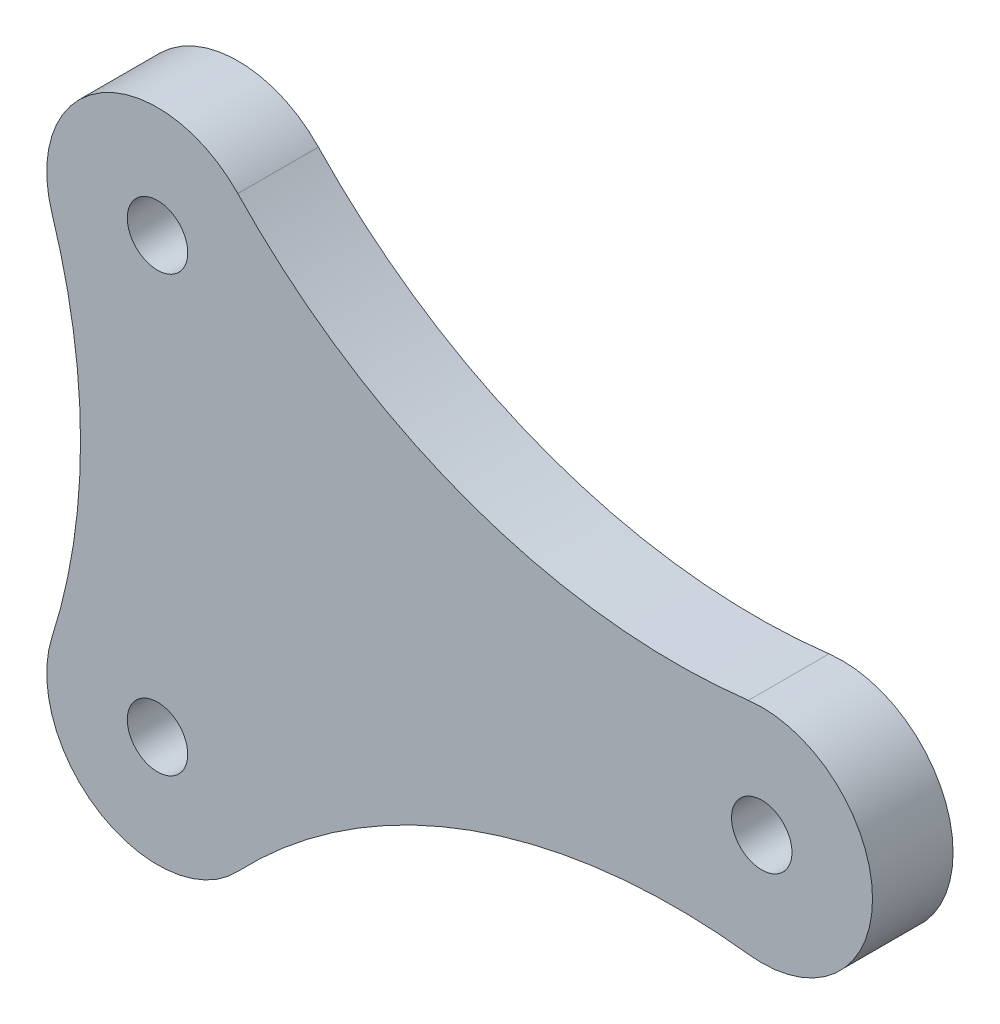
ISO-10303-21;
HEADER;
FILE_DESCRIPTION(('STEP AP214'),'2;1');
FILE_NAME('part.step','',(''),(''),'','','');
FILE_SCHEMA(('AUTOMOTIVE_DESIGN { 1 0 10303 214 1 1 1 1 }'));
ENDSEC;
DATA;
#1=APPLICATION_CONTEXT('core data for automotive mechanical design processes');
#2=APPLICATION_PROTOCOL_DEFINITION('international standard','automotive_design',2000,#1);
#3=PRODUCT_CONTEXT('',#1,'mechanical');
#4=PRODUCT('Part','Part','',(#3));
#5=PRODUCT_RELATED_PRODUCT_CATEGORY('part','',(#4));
#6=PRODUCT_DEFINITION_FORMATION('','',#4);
#7=PRODUCT_DEFINITION_CONTEXT('part definition',#1,'design');
#8=PRODUCT_DEFINITION('design','',#6,#7);
#9=PRODUCT_DEFINITION_SHAPE('','',#8);
#10=(LENGTH_UNIT() NAMED_UNIT(*) SI_UNIT(.MILLI.,.METRE.));
#11=(NAMED_UNIT(*) PLANE_ANGLE_UNIT() SI_UNIT($,.RADIAN.));
#12=(NAMED_UNIT(*) SI_UNIT($,.STERADIAN.) SOLID_ANGLE_UNIT());
#13=UNCERTAINTY_MEASURE_WITH_UNIT(LENGTH_MEASURE(1.E-05),#10,'distance_accuracy_value','');
#14=(GEOMETRIC_REPRESENTATION_CONTEXT(3) GLOBAL_UNCERTAINTY_ASSIGNED_CONTEXT((#13)) GLOBAL_UNIT_ASSIGNED_CONTEXT((#10,
#11,#12)) REPRESENTATION_CONTEXT('',''));
#15=CARTESIAN_POINT('',(0.,0.,0.));
#16=DIRECTION('',(0.,0.,1.));
#17=DIRECTION('',(1.,0.,0.));
#18=AXIS2_PLACEMENT_3D('',#15,#16,#17);
#19=CARTESIAN_POINT('',(-33.8220900448213,10.785,4.));
#20=DIRECTION('',(0.,0.,-1.));
#21=DIRECTION('',(-1.,0.,0.));
#22=AXIS2_PLACEMENT_3D('',#19,#20,#21);
#23=CYLINDRICAL_SURFACE('',#22,30.);
#24=CARTESIAN_POINT('',(-33.8220900448213,10.785,0.));
#25=DIRECTION('',(0.,0.,1.));
#26=DIRECTION('',(1.,0.,0.));
#27=AXIS2_PLACEMENT_3D('',#24,#25,#26);
#28=CIRCLE('',#27,30.);
#29=CARTESIAN_POINT('',(-5.2400421196202,19.8990845070423,0.));
#30=VERTEX_POINT('',#29);
#31=CARTESIAN_POINT('',(-5.2400421196202,1.67091549295775,0.));
#32=VERTEX_POINT('',#31);
#33=EDGE_CURVE('E130',#30,#32,#28,.F.);
#34=ORIENTED_EDGE('',*,*,#33,.T.);
#35=DIRECTION('',(0.,0.,-1.));
#36=VECTOR('',#35,1.);
#37=CARTESIAN_POINT('',(-5.2400421196202,1.67091549295775,4.));
#38=LINE('',#37,#36);
#39=CARTESIAN_POINT('',(-5.2400421196202,1.67091549295775,4.));
#40=VERTEX_POINT('',#39);
#41=EDGE_CURVE('E11',#40,#32,#38,.T.);
#42=ORIENTED_EDGE('',*,*,#41,.F.);
#43=CARTESIAN_POINT('',(-33.8220900448213,10.785,4.));
#44=DIRECTION('',(0.,0.,1.));
#45=DIRECTION('',(1.,0.,0.));
#46=AXIS2_PLACEMENT_3D('',#43,#44,#45);
#47=CIRCLE('',#46,30.);
#48=CARTESIAN_POINT('',(-5.2400421196202,19.8990845070423,4.));
#49=VERTEX_POINT('',#48);
#50=EDGE_CURVE('E150',#49,#40,#47,.F.);
#51=ORIENTED_EDGE('',*,*,#50,.F.);
#52=DIRECTION('',(0.,0.,-1.));
#53=VECTOR('',#52,1.);
#54=CARTESIAN_POINT('',(-5.2400421196202,19.8990845070423,4.));
#55=LINE('',#54,#53);
#56=EDGE_CURVE('E129',#49,#30,#55,.T.);
#57=ORIENTED_EDGE('',*,*,#56,.T.);
#58=EDGE_LOOP('',(#34,#42,#51,#57));
#59=FACE_BOUND('',#58,.T.);
#60=ADVANCED_FACE('F37',(#59),#23,.F.);
#61=CARTESIAN_POINT('',(0.,0.,4.));
#62=DIRECTION('',(0.,0.,-1.));
#63=DIRECTION('',(-1.,0.,0.));
#64=AXIS2_PLACEMENT_3D('',#61,#62,#63);
#65=CYLINDRICAL_SURFACE('',#64,5.5);
#66=CARTESIAN_POINT('',(0.,0.,0.));
#67=DIRECTION('',(0.,0.,1.));
#68=DIRECTION('',(1.,0.,0.));
#69=AXIS2_PLACEMENT_3D('',#66,#67,#68);
#70=CIRCLE('',#69,5.5);
#71=CARTESIAN_POINT('',(3.98649835890473,-3.78917284304239,0.));
#72=VERTEX_POINT('',#71);
#73=EDGE_CURVE('E133',#32,#72,#70,.T.);
#74=ORIENTED_EDGE('',*,*,#73,.T.);
#75=DIRECTION('',(0.,0.,-1.));
#76=VECTOR('',#75,1.);
#77=CARTESIAN_POINT('',(3.98649835890473,-3.78917284304239,4.));
#78=LINE('',#77,#76);
#79=CARTESIAN_POINT('',(3.98649835890473,-3.78917284304239,4.));
#80=VERTEX_POINT('',#79);
#81=EDGE_CURVE('E45',#80,#72,#78,.T.);
#82=ORIENTED_EDGE('',*,*,#81,.F.);
#83=CARTESIAN_POINT('',(0.,0.,4.));
#84=DIRECTION('',(0.,0.,1.));
#85=DIRECTION('',(1.,0.,0.));
#86=AXIS2_PLACEMENT_3D('',#83,#84,#85);
#87=CIRCLE('',#86,5.5);
#88=EDGE_CURVE('E86',#40,#80,#87,.T.);
#89=ORIENTED_EDGE('',*,*,#88,.F.);
#90=ORIENTED_EDGE('',*,*,#41,.T.);
#91=EDGE_LOOP('',(#74,#82,#89,#90));
#92=FACE_BOUND('',#91,.T.);
#93=ADVANCED_FACE('F180',(#92),#65,.T.);
#94=CARTESIAN_POINT('',(25.7310348620214,-24.4573883505463,4.));
#95=DIRECTION('',(0.,0.,-1.));
#96=DIRECTION('',(-1.,0.,0.));
#97=AXIS2_PLACEMENT_3D('',#94,#95,#96);
#98=CYLINDRICAL_SURFACE('',#97,30.);
#99=CARTESIAN_POINT('',(25.7310348620214,-24.4573883505463,0.));
#100=DIRECTION('',(0.,0.,1.));
#101=DIRECTION('',(1.,0.,0.));
#102=AXIS2_PLACEMENT_3D('',#99,#100,#101);
#103=CIRCLE('',#102,30.);
#104=CARTESIAN_POINT('',(29.3386110349611,5.32491166399987,0.));
#105=VERTEX_POINT('',#104);
#106=EDGE_CURVE('E135',#72,#105,#103,.F.);
#107=ORIENTED_EDGE('',*,*,#106,.T.);
#108=DIRECTION('',(0.,0.,-1.));
#109=VECTOR('',#108,1.);
#110=CARTESIAN_POINT('',(29.3386110349611,5.32491166399987,4.));
#111=LINE('',#110,#109);
#112=CARTESIAN_POINT('',(29.3386110349611,5.32491166399987,4.));
#113=VERTEX_POINT('',#112);
#114=EDGE_CURVE('E113',#113,#105,#111,.T.);
#115=ORIENTED_EDGE('',*,*,#114,.F.);
#116=CARTESIAN_POINT('',(25.7310348620214,-24.4573883505463,4.));
#117=DIRECTION('',(0.,0.,1.));
#118=DIRECTION('',(1.,0.,0.));
#119=AXIS2_PLACEMENT_3D('',#116,#117,#118);
#120=CIRCLE('',#119,30.);
#121=EDGE_CURVE('E100',#80,#113,#120,.F.);
#122=ORIENTED_EDGE('',*,*,#121,.F.);
#123=ORIENTED_EDGE('',*,*,#81,.T.);
#124=EDGE_LOOP('',(#107,#115,#122,#123));
#125=FACE_BOUND('',#124,.T.);
#126=ADVANCED_FACE('F156',(#125),#98,.F.);
#127=CARTESIAN_POINT('',(30.,10.785,4.));
#128=DIRECTION('',(0.,0.,-1.));
#129=DIRECTION('',(-1.,0.,0.));
#130=AXIS2_PLACEMENT_3D('',#127,#128,#129);
#131=CYLINDRICAL_SURFACE('',#130,5.5);
#132=CARTESIAN_POINT('',(30.,10.785,0.));
#133=DIRECTION('',(0.,0.,1.));
#134=DIRECTION('',(1.,0.,0.));
#135=AXIS2_PLACEMENT_3D('',#132,#133,#134);
#136=CIRCLE('',#135,5.5);
#137=CARTESIAN_POINT('',(29.3386110349611,16.2450883360001,0.));
#138=VERTEX_POINT('',#137);
#139=EDGE_CURVE('E109',#105,#138,#136,.T.);
#140=ORIENTED_EDGE('',*,*,#139,.T.);
#141=DIRECTION('',(0.,0.,-1.));
#142=VECTOR('',#141,1.);
#143=CARTESIAN_POINT('',(29.3386110349611,16.2450883360001,4.));
#144=LINE('',#143,#142);
#145=CARTESIAN_POINT('',(29.3386110349611,16.2450883360001,4.));
#146=VERTEX_POINT('',#145);
#147=EDGE_CURVE('E106',#146,#138,#144,.T.);
#148=ORIENTED_EDGE('',*,*,#147,.F.);
#149=CARTESIAN_POINT('',(30.,10.785,4.));
#150=DIRECTION('',(0.,0.,1.));
#151=DIRECTION('',(1.,0.,0.));
#152=AXIS2_PLACEMENT_3D('',#149,#150,#151);
#153=CIRCLE('',#152,5.5);
#154=EDGE_CURVE('E93',#113,#146,#153,.T.);
#155=ORIENTED_EDGE('',*,*,#154,.F.);
#156=ORIENTED_EDGE('',*,*,#114,.T.);
#157=EDGE_LOOP('',(#140,#148,#155,#156));
#158=FACE_BOUND('',#157,.T.);
#159=ADVANCED_FACE('F107',(#158),#131,.T.);
#160=CARTESIAN_POINT('',(25.7310348620214,46.0273883505463,4.));
#161=DIRECTION('',(0.,0.,-1.));
#162=DIRECTION('',(-1.,0.,0.));
#163=AXIS2_PLACEMENT_3D('',#160,#161,#162);
#164=CYLINDRICAL_SURFACE('',#163,30.);
#165=CARTESIAN_POINT('',(25.7310348620214,46.0273883505463,0.));
#166=DIRECTION('',(0.,0.,1.));
#167=DIRECTION('',(1.,0.,0.));
#168=AXIS2_PLACEMENT_3D('',#165,#166,#167);
#169=CIRCLE('',#168,30.);
#170=CARTESIAN_POINT('',(3.98649835890472,25.3591728430424,0.));
#171=VERTEX_POINT('',#170);
#172=EDGE_CURVE('E138',#171,#138,#169,.T.);
#173=ORIENTED_EDGE('',*,*,#172,.F.);
#174=DIRECTION('',(0.,0.,-1.));
#175=VECTOR('',#174,1.);
#176=CARTESIAN_POINT('',(3.98649835890472,25.3591728430424,4.));
#177=LINE('',#176,#175);
#178=CARTESIAN_POINT('',(3.98649835890472,25.3591728430424,4.));
#179=VERTEX_POINT('',#178);
#180=EDGE_CURVE('E75',#179,#171,#177,.T.);
#181=ORIENTED_EDGE('',*,*,#180,.F.);
#182=CARTESIAN_POINT('',(25.7310348620214,46.0273883505463,4.));
#183=DIRECTION('',(0.,0.,1.));
#184=DIRECTION('',(1.,0.,0.));
#185=AXIS2_PLACEMENT_3D('',#182,#183,#184);
#186=CIRCLE('',#185,30.);
#187=EDGE_CURVE('E98',#179,#146,#186,.T.);
#188=ORIENTED_EDGE('',*,*,#187,.T.);
#189=ORIENTED_EDGE('',*,*,#147,.T.);
#190=EDGE_LOOP('',(#173,#181,#188,#189));
#191=FACE_BOUND('',#190,.T.);
#192=ADVANCED_FACE('F115',(#191),#164,.F.);
#193=CARTESIAN_POINT('',(30.,10.785,4.));
#194=DIRECTION('',(0.,0.,-1.));
#195=DIRECTION('',(-1.,0.,0.));
#196=AXIS2_PLACEMENT_3D('',#193,#194,#195);
#197=CYLINDRICAL_SURFACE('',#196,1.5);
#198=CARTESIAN_POINT('',(30.,10.785,4.));
#199=DIRECTION('',(0.,0.,1.));
#200=DIRECTION('',(1.,0.,0.));
#201=AXIS2_PLACEMENT_3D('',#198,#199,#200);
#202=CIRCLE('',#201,1.5);
#203=CARTESIAN_POINT('',(31.5,10.785,4.));
#204=VERTEX_POINT('',#203);
#205=EDGE_CURVE('E123',#204,#204,#202,.T.);
#206=ORIENTED_EDGE('',*,*,#205,.T.);
#207=EDGE_LOOP('',(#206));
#208=FACE_BOUND('',#207,.T.);
#209=CARTESIAN_POINT('',(30.,10.785,0.));
#210=DIRECTION('',(0.,0.,1.));
#211=DIRECTION('',(1.,0.,0.));
#212=AXIS2_PLACEMENT_3D('',#209,#210,#211);
#213=CIRCLE('',#212,1.5);
#214=CARTESIAN_POINT('',(31.5,10.785,0.));
#215=VERTEX_POINT('',#214);
#216=EDGE_CURVE('E144',#215,#215,#213,.T.);
#217=ORIENTED_EDGE('',*,*,#216,.F.);
#218=EDGE_LOOP('',(#217));
#219=FACE_BOUND('',#218,.T.);
#220=ADVANCED_FACE('F175',(#208,#219),#197,.F.);
#221=CARTESIAN_POINT('',(0.,21.57,4.));
#222=DIRECTION('',(0.,0.,-1.));
#223=DIRECTION('',(-1.,0.,0.));
#224=AXIS2_PLACEMENT_3D('',#221,#222,#223);
#225=CYLINDRICAL_SURFACE('',#224,1.5);
#226=CARTESIAN_POINT('',(0.,21.57,4.));
#227=DIRECTION('',(0.,0.,1.));
#228=DIRECTION('',(1.,0.,0.));
#229=AXIS2_PLACEMENT_3D('',#226,#227,#228);
#230=CIRCLE('',#229,1.5);
#231=CARTESIAN_POINT('',(1.5,21.57,4.));
#232=VERTEX_POINT('',#231);
#233=EDGE_CURVE('E117',#232,#232,#230,.T.);
#234=ORIENTED_EDGE('',*,*,#233,.T.);
#235=EDGE_LOOP('',(#234));
#236=FACE_BOUND('',#235,.T.);
#237=CARTESIAN_POINT('',(0.,21.57,0.));
#238=DIRECTION('',(0.,0.,1.));
#239=DIRECTION('',(1.,0.,0.));
#240=AXIS2_PLACEMENT_3D('',#237,#238,#239);
#241=CIRCLE('',#240,1.5);
#242=CARTESIAN_POINT('',(1.5,21.57,0.));
#243=VERTEX_POINT('',#242);
#244=EDGE_CURVE('E141',#243,#243,#241,.T.);
#245=ORIENTED_EDGE('',*,*,#244,.F.);
#246=EDGE_LOOP('',(#245));
#247=FACE_BOUND('',#246,.T.);
#248=ADVANCED_FACE('F167',(#236,#247),#225,.F.);
#249=CARTESIAN_POINT('',(0.,21.57,4.));
#250=DIRECTION('',(0.,0.,-1.));
#251=DIRECTION('',(-1.,0.,0.));
#252=AXIS2_PLACEMENT_3D('',#249,#250,#251);
#253=CYLINDRICAL_SURFACE('',#252,5.5);
#254=CARTESIAN_POINT('',(0.,21.57,0.));
#255=DIRECTION('',(0.,0.,1.));
#256=DIRECTION('',(1.,0.,0.));
#257=AXIS2_PLACEMENT_3D('',#254,#255,#256);
#258=CIRCLE('',#257,5.5);
#259=EDGE_CURVE('E78',#171,#30,#258,.T.);
#260=ORIENTED_EDGE('',*,*,#259,.T.);
#261=ORIENTED_EDGE('',*,*,#56,.F.);
#262=CARTESIAN_POINT('',(0.,21.57,4.));
#263=DIRECTION('',(0.,0.,1.));
#264=DIRECTION('',(1.,0.,0.));
#265=AXIS2_PLACEMENT_3D('',#262,#263,#264);
#266=CIRCLE('',#265,5.5);
#267=EDGE_CURVE('E53',#179,#49,#266,.T.);
#268=ORIENTED_EDGE('',*,*,#267,.F.);
#269=ORIENTED_EDGE('',*,*,#180,.T.);
#270=EDGE_LOOP('',(#260,#261,#268,#269));
#271=FACE_BOUND('',#270,.T.);
#272=ADVANCED_FACE('F164',(#271),#253,.T.);
#273=CARTESIAN_POINT('',(0.,0.,4.));
#274=DIRECTION('',(0.,0.,-1.));
#275=DIRECTION('',(-1.,0.,0.));
#276=AXIS2_PLACEMENT_3D('',#273,#274,#275);
#277=CYLINDRICAL_SURFACE('',#276,1.5);
#278=CARTESIAN_POINT('',(0.,0.,4.));
#279=DIRECTION('',(0.,0.,1.));
#280=DIRECTION('',(1.,0.,0.));
#281=AXIS2_PLACEMENT_3D('',#278,#279,#280);
#282=CIRCLE('',#281,1.5);
#283=CARTESIAN_POINT('',(1.5,0.,4.));
#284=VERTEX_POINT('',#283);
#285=EDGE_CURVE('E126',#284,#284,#282,.T.);
#286=ORIENTED_EDGE('',*,*,#285,.T.);
#287=EDGE_LOOP('',(#286));
#288=FACE_BOUND('',#287,.T.);
#289=CARTESIAN_POINT('',(0.,0.,0.));
#290=DIRECTION('',(0.,0.,1.));
#291=DIRECTION('',(1.,0.,0.));
#292=AXIS2_PLACEMENT_3D('',#289,#290,#291);
#293=CIRCLE('',#292,1.5);
#294=CARTESIAN_POINT('',(1.5,0.,0.));
#295=VERTEX_POINT('',#294);
#296=EDGE_CURVE('E147',#295,#295,#293,.T.);
#297=ORIENTED_EDGE('',*,*,#296,.F.);
#298=EDGE_LOOP('',(#297));
#299=FACE_BOUND('',#298,.T.);
#300=ADVANCED_FACE('F166',(#288,#299),#277,.F.);
#301=CARTESIAN_POINT('',(0.,0.,4.));
#302=DIRECTION('',(0.,0.,1.));
#303=DIRECTION('',(1.,0.,0.));
#304=AXIS2_PLACEMENT_3D('',#301,#302,#303);
#305=PLANE('',#304);
#306=ORIENTED_EDGE('',*,*,#50,.T.);
#307=ORIENTED_EDGE('',*,*,#88,.T.);
#308=ORIENTED_EDGE('',*,*,#121,.T.);
#309=ORIENTED_EDGE('',*,*,#154,.T.);
#310=ORIENTED_EDGE('',*,*,#187,.F.);
#311=ORIENTED_EDGE('',*,*,#267,.T.);
#312=EDGE_LOOP('',(#306,#307,#308,#309,#310,#311));
#313=FACE_BOUND('',#312,.T.);
#314=ORIENTED_EDGE('',*,*,#233,.F.);
#315=EDGE_LOOP('',(#314));
#316=FACE_BOUND('',#315,.T.);
#317=ORIENTED_EDGE('',*,*,#205,.F.);
#318=EDGE_LOOP('',(#317));
#319=FACE_BOUND('',#318,.T.);
#320=ORIENTED_EDGE('',*,*,#285,.F.);
#321=EDGE_LOOP('',(#320));
#322=FACE_BOUND('',#321,.T.);
#323=ADVANCED_FACE('F95',(#313,#316,#319,#322),#305,.T.);
#324=CARTESIAN_POINT('',(0.,0.,0.));
#325=DIRECTION('',(0.,0.,1.));
#326=DIRECTION('',(1.,0.,0.));
#327=AXIS2_PLACEMENT_3D('',#324,#325,#326);
#328=PLANE('',#327);
#329=ORIENTED_EDGE('',*,*,#33,.F.);
#330=ORIENTED_EDGE('',*,*,#259,.F.);
#331=ORIENTED_EDGE('',*,*,#172,.T.);
#332=ORIENTED_EDGE('',*,*,#139,.F.);
#333=ORIENTED_EDGE('',*,*,#106,.F.);
#334=ORIENTED_EDGE('',*,*,#73,.F.);
#335=EDGE_LOOP('',(#329,#330,#331,#332,#333,#334));
#336=FACE_BOUND('',#335,.T.);
#337=ORIENTED_EDGE('',*,*,#244,.T.);
#338=EDGE_LOOP('',(#337));
#339=FACE_BOUND('',#338,.T.);
#340=ORIENTED_EDGE('',*,*,#216,.T.);
#341=EDGE_LOOP('',(#340));
#342=FACE_BOUND('',#341,.T.);
#343=ORIENTED_EDGE('',*,*,#296,.T.);
#344=EDGE_LOOP('',(#343));
#345=FACE_BOUND('',#344,.T.);
#346=ADVANCED_FACE('F159',(#336,#339,#342,#345),#328,.F.);
#347=CLOSED_SHELL('',(#60,#93,#126,#159,#192,#220,#248,#272,#300,#323,#346));
#348=MANIFOLD_SOLID_BREP('B2',#347);
#349=ADVANCED_BREP_SHAPE_REPRESENTATION('',(#18,#348),#14);
#350=SHAPE_DEFINITION_REPRESENTATION(#9,#349);
ENDSEC;
END-ISO-10303-21;
